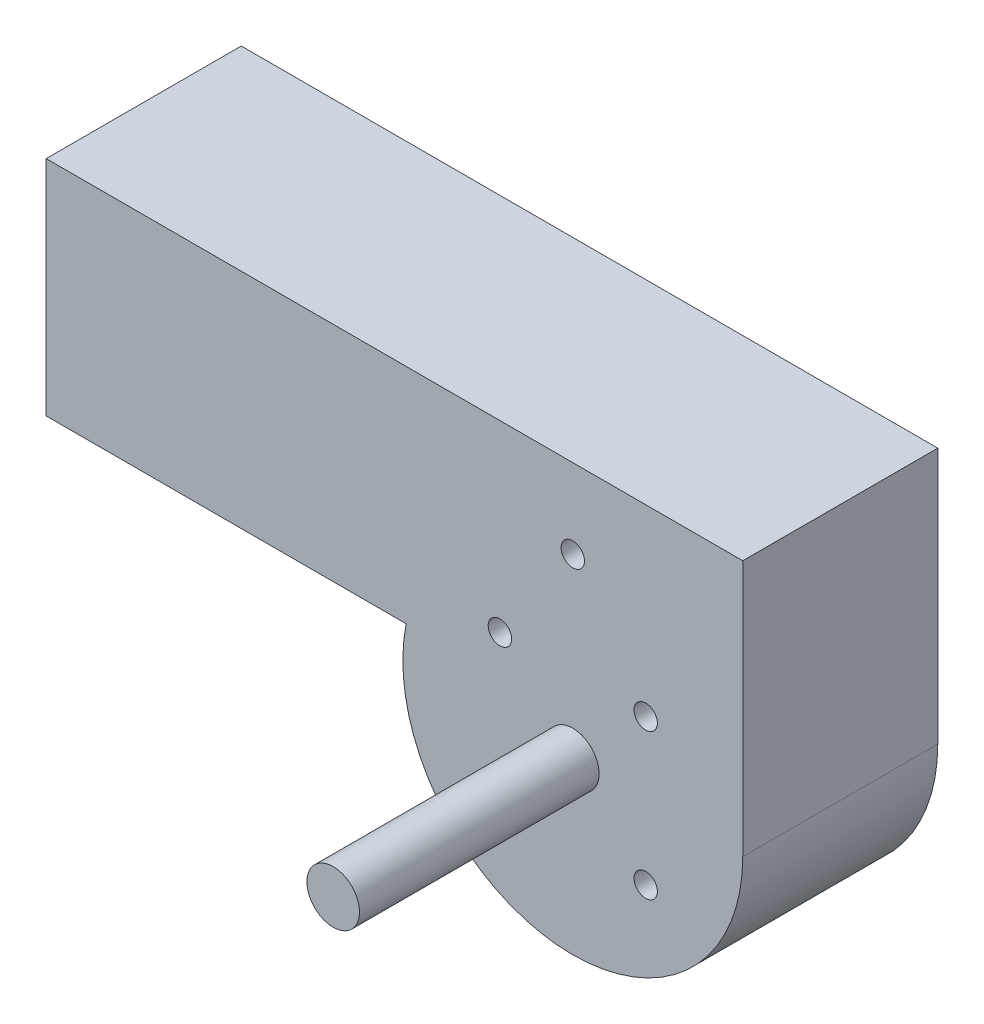
ISO-10303-21;
HEADER;
FILE_DESCRIPTION(('STEP AP214'),'2;1');
FILE_NAME('part.step','',(''),(''),'','','');
FILE_SCHEMA(('AUTOMOTIVE_DESIGN { 1 0 10303 214 1 1 1 1 }'));
ENDSEC;
DATA;
#1=APPLICATION_CONTEXT('core data for automotive mechanical design processes');
#2=APPLICATION_PROTOCOL_DEFINITION('international standard','automotive_design',2000,#1);
#3=PRODUCT_CONTEXT('',#1,'mechanical');
#4=PRODUCT('Part','Part','',(#3));
#5=PRODUCT_RELATED_PRODUCT_CATEGORY('part','',(#4));
#6=PRODUCT_DEFINITION_FORMATION('','',#4);
#7=PRODUCT_DEFINITION_CONTEXT('part definition',#1,'design');
#8=PRODUCT_DEFINITION('design','',#6,#7);
#9=PRODUCT_DEFINITION_SHAPE('','',#8);
#10=(LENGTH_UNIT() NAMED_UNIT(*) SI_UNIT(.MILLI.,.METRE.));
#11=(NAMED_UNIT(*) PLANE_ANGLE_UNIT() SI_UNIT($,.RADIAN.));
#12=(NAMED_UNIT(*) SI_UNIT($,.STERADIAN.) SOLID_ANGLE_UNIT());
#13=UNCERTAINTY_MEASURE_WITH_UNIT(LENGTH_MEASURE(1.E-05),#10,'distance_accuracy_value','');
#14=(GEOMETRIC_REPRESENTATION_CONTEXT(3) GLOBAL_UNCERTAINTY_ASSIGNED_CONTEXT((#13)) GLOBAL_UNIT_ASSIGNED_CONTEXT((#10,
#11,#12)) REPRESENTATION_CONTEXT('',''));
#15=CARTESIAN_POINT('',(0.,0.,0.));
#16=DIRECTION('',(0.,0.,1.));
#17=DIRECTION('',(1.,0.,0.));
#18=AXIS2_PLACEMENT_3D('',#15,#16,#17);
#19=CARTESIAN_POINT('',(-189.,92.,-70.));
#20=DIRECTION('',(-1.,0.,0.));
#21=DIRECTION('',(0.,0.,1.));
#22=AXIS2_PLACEMENT_3D('',#19,#20,#21);
#23=PLANE('',#22);
#24=DIRECTION('',(0.,-1.,0.));
#25=VECTOR('',#24,1.);
#26=CARTESIAN_POINT('',(-189.,92.,0.));
#27=LINE('',#26,#25);
#28=CARTESIAN_POINT('',(-189.,92.,0.));
#29=VERTEX_POINT('',#28);
#30=CARTESIAN_POINT('',(-189.,12.,0.));
#31=VERTEX_POINT('',#30);
#32=EDGE_CURVE('E210',#29,#31,#27,.T.);
#33=ORIENTED_EDGE('',*,*,#32,.F.);
#34=DIRECTION('',(0.,0.,1.));
#35=VECTOR('',#34,1.);
#36=CARTESIAN_POINT('',(-189.,92.,-70.));
#37=LINE('',#36,#35);
#38=CARTESIAN_POINT('',(-189.,92.,-70.));
#39=VERTEX_POINT('',#38);
#40=EDGE_CURVE('E12',#39,#29,#37,.T.);
#41=ORIENTED_EDGE('',*,*,#40,.F.);
#42=DIRECTION('',(0.,-1.,0.));
#43=VECTOR('',#42,1.);
#44=CARTESIAN_POINT('',(-189.,92.,-70.));
#45=LINE('',#44,#43);
#46=CARTESIAN_POINT('',(-189.,12.,-70.));
#47=VERTEX_POINT('',#46);
#48=EDGE_CURVE('E205',#39,#47,#45,.T.);
#49=ORIENTED_EDGE('',*,*,#48,.T.);
#50=DIRECTION('',(0.,0.,1.));
#51=VECTOR('',#50,1.);
#52=CARTESIAN_POINT('',(-189.,12.,-70.));
#53=LINE('',#52,#51);
#54=EDGE_CURVE('E136',#47,#31,#53,.T.);
#55=ORIENTED_EDGE('',*,*,#54,.T.);
#56=EDGE_LOOP('',(#33,#41,#49,#55));
#57=FACE_BOUND('',#56,.T.);
#58=ADVANCED_FACE('F133',(#57),#23,.T.);
#59=CARTESIAN_POINT('',(61.,92.,-70.));
#60=DIRECTION('',(0.,1.,0.));
#61=DIRECTION('',(-1.,0.,0.));
#62=AXIS2_PLACEMENT_3D('',#59,#60,#61);
#63=PLANE('',#62);
#64=DIRECTION('',(-1.,0.,0.));
#65=VECTOR('',#64,1.);
#66=CARTESIAN_POINT('',(61.,92.,0.));
#67=LINE('',#66,#65);
#68=CARTESIAN_POINT('',(61.,92.,0.));
#69=VERTEX_POINT('',#68);
#70=EDGE_CURVE('E220',#69,#29,#67,.T.);
#71=ORIENTED_EDGE('',*,*,#70,.F.);
#72=DIRECTION('',(0.,0.,1.));
#73=VECTOR('',#72,1.);
#74=CARTESIAN_POINT('',(61.,92.,-70.));
#75=LINE('',#74,#73);
#76=CARTESIAN_POINT('',(61.,92.,-70.));
#77=VERTEX_POINT('',#76);
#78=EDGE_CURVE('E142',#77,#69,#75,.T.);
#79=ORIENTED_EDGE('',*,*,#78,.F.);
#80=DIRECTION('',(-1.,0.,0.));
#81=VECTOR('',#80,1.);
#82=CARTESIAN_POINT('',(61.,92.,-70.));
#83=LINE('',#82,#81);
#84=EDGE_CURVE('E200',#77,#39,#83,.T.);
#85=ORIENTED_EDGE('',*,*,#84,.T.);
#86=ORIENTED_EDGE('',*,*,#40,.T.);
#87=EDGE_LOOP('',(#71,#79,#85,#86));
#88=FACE_BOUND('',#87,.T.);
#89=ADVANCED_FACE('F226',(#88),#63,.T.);
#90=CARTESIAN_POINT('',(61.,0.,-70.));
#91=DIRECTION('',(1.,0.,0.));
#92=DIRECTION('',(0.,0.,-1.));
#93=AXIS2_PLACEMENT_3D('',#90,#91,#92);
#94=PLANE('',#93);
#95=DIRECTION('',(0.,1.,0.));
#96=VECTOR('',#95,1.);
#97=CARTESIAN_POINT('',(61.,0.,0.));
#98=LINE('',#97,#96);
#99=CARTESIAN_POINT('',(61.,0.,0.));
#100=VERTEX_POINT('',#99);
#101=EDGE_CURVE('E189',#100,#69,#98,.T.);
#102=ORIENTED_EDGE('',*,*,#101,.F.);
#103=DIRECTION('',(0.,0.,1.));
#104=VECTOR('',#103,1.);
#105=CARTESIAN_POINT('',(61.,0.,-70.));
#106=LINE('',#105,#104);
#107=CARTESIAN_POINT('',(61.,0.,-70.));
#108=VERTEX_POINT('',#107);
#109=EDGE_CURVE('E184',#108,#100,#106,.T.);
#110=ORIENTED_EDGE('',*,*,#109,.F.);
#111=DIRECTION('',(0.,1.,0.));
#112=VECTOR('',#111,1.);
#113=CARTESIAN_POINT('',(61.,0.,-70.));
#114=LINE('',#113,#112);
#115=EDGE_CURVE('E187',#108,#77,#114,.T.);
#116=ORIENTED_EDGE('',*,*,#115,.T.);
#117=ORIENTED_EDGE('',*,*,#78,.T.);
#118=EDGE_LOOP('',(#102,#110,#116,#117));
#119=FACE_BOUND('',#118,.T.);
#120=ADVANCED_FACE('F186',(#119),#94,.T.);
#121=CARTESIAN_POINT('',(0.,0.,-70.));
#122=DIRECTION('',(0.,0.,1.));
#123=DIRECTION('',(1.,0.,0.));
#124=AXIS2_PLACEMENT_3D('',#121,#122,#123);
#125=CYLINDRICAL_SURFACE('',#124,61.);
#126=CARTESIAN_POINT('',(0.,0.,0.));
#127=DIRECTION('',(0.,0.,1.));
#128=DIRECTION('',(1.,0.,0.));
#129=AXIS2_PLACEMENT_3D('',#126,#127,#128);
#130=CIRCLE('',#129,61.);
#131=CARTESIAN_POINT('',(-59.8080262172227,12.,0.));
#132=VERTEX_POINT('',#131);
#133=EDGE_CURVE('E217',#132,#100,#130,.T.);
#134=ORIENTED_EDGE('',*,*,#133,.F.);
#135=DIRECTION('',(0.,0.,1.));
#136=VECTOR('',#135,1.);
#137=CARTESIAN_POINT('',(-59.8080262172227,12.,-70.));
#138=LINE('',#137,#136);
#139=CARTESIAN_POINT('',(-59.8080262172227,12.,-70.));
#140=VERTEX_POINT('',#139);
#141=EDGE_CURVE('E194',#140,#132,#138,.T.);
#142=ORIENTED_EDGE('',*,*,#141,.F.);
#143=CARTESIAN_POINT('',(0.,0.,-70.));
#144=DIRECTION('',(0.,0.,1.));
#145=DIRECTION('',(1.,0.,0.));
#146=AXIS2_PLACEMENT_3D('',#143,#144,#145);
#147=CIRCLE('',#146,61.);
#148=EDGE_CURVE('E199',#140,#108,#147,.T.);
#149=ORIENTED_EDGE('',*,*,#148,.T.);
#150=ORIENTED_EDGE('',*,*,#109,.T.);
#151=EDGE_LOOP('',(#134,#142,#149,#150));
#152=FACE_BOUND('',#151,.T.);
#153=ADVANCED_FACE('F202',(#152),#125,.T.);
#154=CARTESIAN_POINT('',(-189.,12.,-70.));
#155=DIRECTION('',(0.,-1.,0.));
#156=DIRECTION('',(0.,0.,-1.));
#157=AXIS2_PLACEMENT_3D('',#154,#155,#156);
#158=PLANE('',#157);
#159=DIRECTION('',(1.,0.,0.));
#160=VECTOR('',#159,1.);
#161=CARTESIAN_POINT('',(-189.,12.,0.));
#162=LINE('',#161,#160);
#163=EDGE_CURVE('E213',#31,#132,#162,.T.);
#164=ORIENTED_EDGE('',*,*,#163,.F.);
#165=ORIENTED_EDGE('',*,*,#54,.F.);
#166=DIRECTION('',(1.,0.,0.));
#167=VECTOR('',#166,1.);
#168=CARTESIAN_POINT('',(-189.,12.,-70.));
#169=LINE('',#168,#167);
#170=EDGE_CURVE('E203',#47,#140,#169,.T.);
#171=ORIENTED_EDGE('',*,*,#170,.T.);
#172=ORIENTED_EDGE('',*,*,#141,.T.);
#173=EDGE_LOOP('',(#164,#165,#171,#172));
#174=FACE_BOUND('',#173,.T.);
#175=ADVANCED_FACE('F223',(#174),#158,.T.);
#176=CARTESIAN_POINT('',(0.,0.,-70.));
#177=DIRECTION('',(0.,0.,1.));
#178=DIRECTION('',(1.,0.,0.));
#179=AXIS2_PLACEMENT_3D('',#176,#177,#178);
#180=PLANE('',#179);
#181=CARTESIAN_POINT('',(-26.1629509039024,-26.1629509039021,-70.));
#182=DIRECTION('',(0.,0.,1.));
#183=DIRECTION('',(1.,0.,0.));
#184=AXIS2_PLACEMENT_3D('',#181,#182,#183);
#185=CIRCLE('',#184,4.2);
#186=CARTESIAN_POINT('',(-21.9629509039024,-26.1629509039021,-70.));
#187=VERTEX_POINT('',#186);
#188=EDGE_CURVE('E286',#187,#187,#185,.T.);
#189=ORIENTED_EDGE('',*,*,#188,.T.);
#190=EDGE_LOOP('',(#189));
#191=FACE_BOUND('',#190,.T.);
#192=CARTESIAN_POINT('',(26.1629509039022,-26.1629509039023,-70.));
#193=DIRECTION('',(0.,0.,1.));
#194=DIRECTION('',(1.,0.,0.));
#195=AXIS2_PLACEMENT_3D('',#192,#193,#194);
#196=CIRCLE('',#195,4.2);
#197=CARTESIAN_POINT('',(30.3629509039022,-26.1629509039023,-70.));
#198=VERTEX_POINT('',#197);
#199=EDGE_CURVE('E293',#198,#198,#196,.T.);
#200=ORIENTED_EDGE('',*,*,#199,.T.);
#201=EDGE_LOOP('',(#200));
#202=FACE_BOUND('',#201,.T.);
#203=CARTESIAN_POINT('',(26.1629509039022,26.1629509039023,-70.));
#204=DIRECTION('',(0.,0.,1.));
#205=DIRECTION('',(1.,0.,0.));
#206=AXIS2_PLACEMENT_3D('',#203,#204,#205);
#207=CIRCLE('',#206,4.20000000000001);
#208=CARTESIAN_POINT('',(30.3629509039022,26.1629509039023,-70.));
#209=VERTEX_POINT('',#208);
#210=EDGE_CURVE('E299',#209,#209,#207,.T.);
#211=ORIENTED_EDGE('',*,*,#210,.T.);
#212=EDGE_LOOP('',(#211));
#213=FACE_BOUND('',#212,.T.);
#214=CARTESIAN_POINT('',(0.,63.5,-70.));
#215=DIRECTION('',(0.,0.,1.));
#216=DIRECTION('',(1.,0.,0.));
#217=AXIS2_PLACEMENT_3D('',#214,#215,#216);
#218=CIRCLE('',#217,4.2);
#219=CARTESIAN_POINT('',(4.2,63.5,-70.));
#220=VERTEX_POINT('',#219);
#221=EDGE_CURVE('E305',#220,#220,#218,.T.);
#222=ORIENTED_EDGE('',*,*,#221,.T.);
#223=EDGE_LOOP('',(#222));
#224=FACE_BOUND('',#223,.T.);
#225=CARTESIAN_POINT('',(-26.162950903902,26.1629509039025,-70.));
#226=DIRECTION('',(0.,0.,1.));
#227=DIRECTION('',(1.,0.,0.));
#228=AXIS2_PLACEMENT_3D('',#225,#226,#227);
#229=CIRCLE('',#228,4.2);
#230=CARTESIAN_POINT('',(-21.962950903902,26.1629509039025,-70.));
#231=VERTEX_POINT('',#230);
#232=EDGE_CURVE('E214',#231,#231,#229,.T.);
#233=ORIENTED_EDGE('',*,*,#232,.T.);
#234=EDGE_LOOP('',(#233));
#235=FACE_BOUND('',#234,.T.);
#236=ORIENTED_EDGE('',*,*,#48,.F.);
#237=ORIENTED_EDGE('',*,*,#84,.F.);
#238=ORIENTED_EDGE('',*,*,#115,.F.);
#239=ORIENTED_EDGE('',*,*,#148,.F.);
#240=ORIENTED_EDGE('',*,*,#170,.F.);
#241=EDGE_LOOP('',(#236,#237,#238,#239,#240));
#242=FACE_BOUND('',#241,.T.);
#243=ADVANCED_FACE('F198',(#191,#202,#213,#224,#235,#242),#180,.F.);
#244=CARTESIAN_POINT('',(0.,0.,0.));
#245=DIRECTION('',(0.,0.,1.));
#246=DIRECTION('',(1.,0.,0.));
#247=AXIS2_PLACEMENT_3D('',#244,#245,#246);
#248=PLANE('',#247);
#249=CARTESIAN_POINT('',(0.,0.,0.));
#250=DIRECTION('',(0.,0.,1.));
#251=DIRECTION('',(1.,0.,0.));
#252=AXIS2_PLACEMENT_3D('',#249,#250,#251);
#253=CIRCLE('',#252,9.44);
#254=CARTESIAN_POINT('',(9.44,0.,0.));
#255=VERTEX_POINT('',#254);
#256=EDGE_CURVE('E283',#255,#255,#253,.T.);
#257=ORIENTED_EDGE('',*,*,#256,.F.);
#258=EDGE_LOOP('',(#257));
#259=FACE_BOUND('',#258,.T.);
#260=CARTESIAN_POINT('',(-26.1629509039024,-26.1629509039021,0.));
#261=DIRECTION('',(0.,0.,1.));
#262=DIRECTION('',(1.,0.,0.));
#263=AXIS2_PLACEMENT_3D('',#260,#261,#262);
#264=CIRCLE('',#263,4.2);
#265=CARTESIAN_POINT('',(-21.9629509039024,-26.1629509039021,0.));
#266=VERTEX_POINT('',#265);
#267=EDGE_CURVE('E282',#266,#266,#264,.T.);
#268=ORIENTED_EDGE('',*,*,#267,.F.);
#269=EDGE_LOOP('',(#268));
#270=FACE_BOUND('',#269,.T.);
#271=CARTESIAN_POINT('',(26.1629509039022,-26.1629509039023,0.));
#272=DIRECTION('',(0.,0.,1.));
#273=DIRECTION('',(1.,0.,0.));
#274=AXIS2_PLACEMENT_3D('',#271,#272,#273);
#275=CIRCLE('',#274,4.2);
#276=CARTESIAN_POINT('',(30.3629509039022,-26.1629509039023,0.));
#277=VERTEX_POINT('',#276);
#278=EDGE_CURVE('E291',#277,#277,#275,.T.);
#279=ORIENTED_EDGE('',*,*,#278,.F.);
#280=EDGE_LOOP('',(#279));
#281=FACE_BOUND('',#280,.T.);
#282=CARTESIAN_POINT('',(26.1629509039022,26.1629509039023,0.));
#283=DIRECTION('',(0.,0.,1.));
#284=DIRECTION('',(1.,0.,0.));
#285=AXIS2_PLACEMENT_3D('',#282,#283,#284);
#286=CIRCLE('',#285,4.20000000000001);
#287=CARTESIAN_POINT('',(30.3629509039022,26.1629509039023,0.));
#288=VERTEX_POINT('',#287);
#289=EDGE_CURVE('E296',#288,#288,#286,.T.);
#290=ORIENTED_EDGE('',*,*,#289,.F.);
#291=EDGE_LOOP('',(#290));
#292=FACE_BOUND('',#291,.T.);
#293=CARTESIAN_POINT('',(0.,63.5,0.));
#294=DIRECTION('',(0.,0.,1.));
#295=DIRECTION('',(1.,0.,0.));
#296=AXIS2_PLACEMENT_3D('',#293,#294,#295);
#297=CIRCLE('',#296,4.2);
#298=CARTESIAN_POINT('',(4.2,63.5,0.));
#299=VERTEX_POINT('',#298);
#300=EDGE_CURVE('E302',#299,#299,#297,.T.);
#301=ORIENTED_EDGE('',*,*,#300,.F.);
#302=EDGE_LOOP('',(#301));
#303=FACE_BOUND('',#302,.T.);
#304=CARTESIAN_POINT('',(-26.162950903902,26.1629509039025,0.));
#305=DIRECTION('',(0.,0.,1.));
#306=DIRECTION('',(1.,0.,0.));
#307=AXIS2_PLACEMENT_3D('',#304,#305,#306);
#308=CIRCLE('',#307,4.2);
#309=CARTESIAN_POINT('',(-21.962950903902,26.1629509039025,0.));
#310=VERTEX_POINT('',#309);
#311=EDGE_CURVE('E308',#310,#310,#308,.T.);
#312=ORIENTED_EDGE('',*,*,#311,.F.);
#313=EDGE_LOOP('',(#312));
#314=FACE_BOUND('',#313,.T.);
#315=ORIENTED_EDGE('',*,*,#32,.T.);
#316=ORIENTED_EDGE('',*,*,#163,.T.);
#317=ORIENTED_EDGE('',*,*,#133,.T.);
#318=ORIENTED_EDGE('',*,*,#101,.T.);
#319=ORIENTED_EDGE('',*,*,#70,.T.);
#320=EDGE_LOOP('',(#315,#316,#317,#318,#319));
#321=FACE_BOUND('',#320,.T.);
#322=ADVANCED_FACE('F225',(#259,#270,#281,#292,#303,#314,#321),#248,.T.);
#323=CARTESIAN_POINT('',(-26.162950903902,26.1629509039025,-70.));
#324=DIRECTION('',(0.,0.,1.));
#325=DIRECTION('',(1.,0.,0.));
#326=AXIS2_PLACEMENT_3D('',#323,#324,#325);
#327=CYLINDRICAL_SURFACE('',#326,4.2);
#328=ORIENTED_EDGE('',*,*,#232,.F.);
#329=EDGE_LOOP('',(#328));
#330=FACE_BOUND('',#329,.T.);
#331=ORIENTED_EDGE('',*,*,#311,.T.);
#332=EDGE_LOOP('',(#331));
#333=FACE_BOUND('',#332,.T.);
#334=ADVANCED_FACE('F246',(#330,#333),#327,.F.);
#335=CARTESIAN_POINT('',(0.,63.5,-70.));
#336=DIRECTION('',(0.,0.,1.));
#337=DIRECTION('',(1.,0.,0.));
#338=AXIS2_PLACEMENT_3D('',#335,#336,#337);
#339=CYLINDRICAL_SURFACE('',#338,4.2);
#340=ORIENTED_EDGE('',*,*,#221,.F.);
#341=EDGE_LOOP('',(#340));
#342=FACE_BOUND('',#341,.T.);
#343=ORIENTED_EDGE('',*,*,#300,.T.);
#344=EDGE_LOOP('',(#343));
#345=FACE_BOUND('',#344,.T.);
#346=ADVANCED_FACE('F253',(#342,#345),#339,.F.);
#347=CARTESIAN_POINT('',(26.1629509039022,26.1629509039023,-70.));
#348=DIRECTION('',(0.,0.,1.));
#349=DIRECTION('',(1.,0.,0.));
#350=AXIS2_PLACEMENT_3D('',#347,#348,#349);
#351=CYLINDRICAL_SURFACE('',#350,4.20000000000001);
#352=ORIENTED_EDGE('',*,*,#210,.F.);
#353=EDGE_LOOP('',(#352));
#354=FACE_BOUND('',#353,.T.);
#355=ORIENTED_EDGE('',*,*,#289,.T.);
#356=EDGE_LOOP('',(#355));
#357=FACE_BOUND('',#356,.T.);
#358=ADVANCED_FACE('F257',(#354,#357),#351,.F.);
#359=CARTESIAN_POINT('',(26.1629509039022,-26.1629509039023,-70.));
#360=DIRECTION('',(0.,0.,1.));
#361=DIRECTION('',(1.,0.,0.));
#362=AXIS2_PLACEMENT_3D('',#359,#360,#361);
#363=CYLINDRICAL_SURFACE('',#362,4.2);
#364=ORIENTED_EDGE('',*,*,#199,.F.);
#365=EDGE_LOOP('',(#364));
#366=FACE_BOUND('',#365,.T.);
#367=ORIENTED_EDGE('',*,*,#278,.T.);
#368=EDGE_LOOP('',(#367));
#369=FACE_BOUND('',#368,.T.);
#370=ADVANCED_FACE('F261',(#366,#369),#363,.F.);
#371=CARTESIAN_POINT('',(-26.1629509039024,-26.1629509039021,-70.));
#372=DIRECTION('',(0.,0.,1.));
#373=DIRECTION('',(1.,0.,0.));
#374=AXIS2_PLACEMENT_3D('',#371,#372,#373);
#375=CYLINDRICAL_SURFACE('',#374,4.2);
#376=ORIENTED_EDGE('',*,*,#188,.F.);
#377=EDGE_LOOP('',(#376));
#378=FACE_BOUND('',#377,.T.);
#379=ORIENTED_EDGE('',*,*,#267,.T.);
#380=EDGE_LOOP('',(#379));
#381=FACE_BOUND('',#380,.T.);
#382=ADVANCED_FACE('F265',(#378,#381),#375,.F.);
#383=CARTESIAN_POINT('',(0.,0.,86.));
#384=DIRECTION('',(0.,0.,-1.));
#385=DIRECTION('',(-1.,0.,0.));
#386=AXIS2_PLACEMENT_3D('',#383,#384,#385);
#387=CYLINDRICAL_SURFACE('',#386,9.44);
#388=CARTESIAN_POINT('',(0.,0.,86.));
#389=DIRECTION('',(0.,0.,1.));
#390=DIRECTION('',(1.,0.,0.));
#391=AXIS2_PLACEMENT_3D('',#388,#389,#390);
#392=CIRCLE('',#391,9.44);
#393=CARTESIAN_POINT('',(9.44,0.,86.));
#394=VERTEX_POINT('',#393);
#395=EDGE_CURVE('E281',#394,#394,#392,.T.);
#396=ORIENTED_EDGE('',*,*,#395,.F.);
#397=EDGE_LOOP('',(#396));
#398=FACE_BOUND('',#397,.T.);
#399=ORIENTED_EDGE('',*,*,#256,.T.);
#400=EDGE_LOOP('',(#399));
#401=FACE_BOUND('',#400,.T.);
#402=ADVANCED_FACE('F269',(#398,#401),#387,.T.);
#403=CARTESIAN_POINT('',(0.,0.,86.));
#404=DIRECTION('',(0.,0.,1.));
#405=DIRECTION('',(1.,0.,0.));
#406=AXIS2_PLACEMENT_3D('',#403,#404,#405);
#407=PLANE('',#406);
#408=ORIENTED_EDGE('',*,*,#395,.T.);
#409=EDGE_LOOP('',(#408));
#410=FACE_BOUND('',#409,.T.);
#411=ADVANCED_FACE('F273',(#410),#407,.T.);
#412=CLOSED_SHELL('',(#58,#89,#120,#153,#175,#243,#322,#334,#346,#358,#370,#382,#402,#411));
#413=MANIFOLD_SOLID_BREP('B2',#412);
#414=ADVANCED_BREP_SHAPE_REPRESENTATION('',(#18,#413),#14);
#415=SHAPE_DEFINITION_REPRESENTATION(#9,#414);
ENDSEC;
END-ISO-10303-21;
